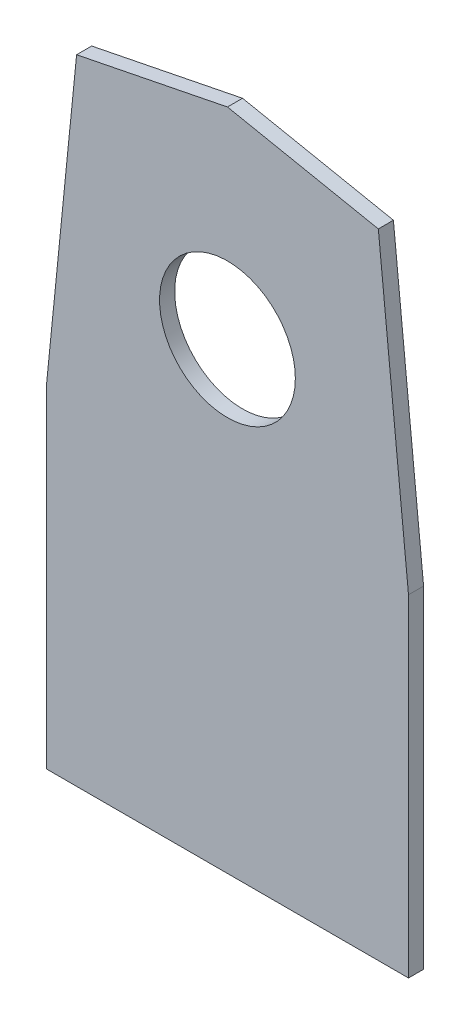
ISO-10303-21;
HEADER;
FILE_DESCRIPTION(('STEP AP214'),'2;1');
FILE_NAME('part.step','',(''),(''),'','','');
FILE_SCHEMA(('AUTOMOTIVE_DESIGN { 1 0 10303 214 1 1 1 1 }'));
ENDSEC;
DATA;
#1=APPLICATION_CONTEXT('core data for automotive mechanical design processes');
#2=APPLICATION_PROTOCOL_DEFINITION('international standard','automotive_design',2000,#1);
#3=PRODUCT_CONTEXT('',#1,'mechanical');
#4=PRODUCT('Part','Part','',(#3));
#5=PRODUCT_RELATED_PRODUCT_CATEGORY('part','',(#4));
#6=PRODUCT_DEFINITION_FORMATION('','',#4);
#7=PRODUCT_DEFINITION_CONTEXT('part definition',#1,'design');
#8=PRODUCT_DEFINITION('design','',#6,#7);
#9=PRODUCT_DEFINITION_SHAPE('','',#8);
#10=(LENGTH_UNIT() NAMED_UNIT(*) SI_UNIT(.MILLI.,.METRE.));
#11=(NAMED_UNIT(*) PLANE_ANGLE_UNIT() SI_UNIT($,.RADIAN.));
#12=(NAMED_UNIT(*) SI_UNIT($,.STERADIAN.) SOLID_ANGLE_UNIT());
#13=UNCERTAINTY_MEASURE_WITH_UNIT(LENGTH_MEASURE(1.E-05),#10,'distance_accuracy_value','');
#14=(GEOMETRIC_REPRESENTATION_CONTEXT(3) GLOBAL_UNCERTAINTY_ASSIGNED_CONTEXT((#13)) GLOBAL_UNIT_ASSIGNED_CONTEXT((#10,
#11,#12)) REPRESENTATION_CONTEXT('',''));
#15=CARTESIAN_POINT('',(0.,0.,0.));
#16=DIRECTION('',(0.,0.,1.));
#17=DIRECTION('',(1.,0.,0.));
#18=AXIS2_PLACEMENT_3D('',#15,#16,#17);
#19=CARTESIAN_POINT('',(-17.2944185212213,86.4720926061065,3.175));
#20=DIRECTION('',(0.196116135138184,-0.98058067569092,0.));
#21=DIRECTION('',(0.98058067569092,0.196116135138184,0.));
#22=AXIS2_PLACEMENT_3D('',#19,#20,#21);
#23=PLANE('',#22);
#24=DIRECTION('',(-0.98058067569092,-0.196116135138184,0.));
#25=VECTOR('',#24,1.);
#26=CARTESIAN_POINT('',(-17.2944185212213,86.4720926061065,0.));
#27=LINE('',#26,#25);
#28=CARTESIAN_POINT('',(-1.91986644476598,89.5470030213976,0.));
#29=VERTEX_POINT('',#28);
#30=CARTESIAN_POINT('',(-33.669866444766,83.1970030213976,0.));
#31=VERTEX_POINT('',#30);
#32=EDGE_CURVE('E126',#29,#31,#27,.T.);
#33=ORIENTED_EDGE('',*,*,#32,.T.);
#34=DIRECTION('',(0.,0.,-1.));
#35=VECTOR('',#34,1.);
#36=CARTESIAN_POINT('',(-33.669866444766,83.1970030213976,3.175));
#37=LINE('',#36,#35);
#38=CARTESIAN_POINT('',(-33.669866444766,83.1970030213976,3.175));
#39=VERTEX_POINT('',#38);
#40=EDGE_CURVE('E11',#39,#31,#37,.T.);
#41=ORIENTED_EDGE('',*,*,#40,.F.);
#42=DIRECTION('',(-0.98058067569092,-0.196116135138184,0.));
#43=VECTOR('',#42,1.);
#44=CARTESIAN_POINT('',(-17.2944185212213,86.4720926061065,3.175));
#45=LINE('',#44,#43);
#46=CARTESIAN_POINT('',(-1.91986644476598,89.5470030213976,3.175));
#47=VERTEX_POINT('',#46);
#48=EDGE_CURVE('E140',#47,#39,#45,.T.);
#49=ORIENTED_EDGE('',*,*,#48,.F.);
#50=DIRECTION('',(0.,0.,-1.));
#51=VECTOR('',#50,1.);
#52=CARTESIAN_POINT('',(-1.91986644476598,89.5470030213976,3.175));
#53=LINE('',#52,#51);
#54=EDGE_CURVE('E125',#47,#29,#53,.T.);
#55=ORIENTED_EDGE('',*,*,#54,.T.);
#56=EDGE_LOOP('',(#33,#41,#49,#55));
#57=FACE_BOUND('',#56,.T.);
#58=ADVANCED_FACE('F35',(#57),#23,.F.);
#59=CARTESIAN_POINT('',(-41.5738284622829,4.15738284622828,3.175));
#60=DIRECTION('',(0.995037190209989,-0.0995037190209987,0.));
#61=DIRECTION('',(0.0995037190209987,0.995037190209989,0.));
#62=AXIS2_PLACEMENT_3D('',#59,#60,#61);
#63=PLANE('',#62);
#64=DIRECTION('',(-0.0995037190209987,-0.995037190209989,0.));
#65=VECTOR('',#64,1.);
#66=CARTESIAN_POINT('',(-41.5738284622829,4.15738284622828,0.));
#67=LINE('',#66,#65);
#68=CARTESIAN_POINT('',(-40.019866444766,19.6970030213976,0.));
#69=VERTEX_POINT('',#68);
#70=EDGE_CURVE('E129',#31,#69,#67,.T.);
#71=ORIENTED_EDGE('',*,*,#70,.T.);
#72=DIRECTION('',(0.,0.,-1.));
#73=VECTOR('',#72,1.);
#74=CARTESIAN_POINT('',(-40.019866444766,19.6970030213976,3.175));
#75=LINE('',#74,#73);
#76=CARTESIAN_POINT('',(-40.019866444766,19.6970030213976,3.175));
#77=VERTEX_POINT('',#76);
#78=EDGE_CURVE('E43',#77,#69,#75,.T.);
#79=ORIENTED_EDGE('',*,*,#78,.F.);
#80=DIRECTION('',(-0.0995037190209987,-0.995037190209989,0.));
#81=VECTOR('',#80,1.);
#82=CARTESIAN_POINT('',(-41.5738284622829,4.15738284622828,3.175));
#83=LINE('',#82,#81);
#84=EDGE_CURVE('E90',#39,#77,#83,.T.);
#85=ORIENTED_EDGE('',*,*,#84,.F.);
#86=ORIENTED_EDGE('',*,*,#40,.T.);
#87=EDGE_LOOP('',(#71,#79,#85,#86));
#88=FACE_BOUND('',#87,.T.);
#89=ADVANCED_FACE('F165',(#88),#63,.F.);
#90=CARTESIAN_POINT('',(-40.019866444766,0.,3.175));
#91=DIRECTION('',(1.,0.,0.));
#92=DIRECTION('',(0.,1.,0.));
#93=AXIS2_PLACEMENT_3D('',#90,#91,#92);
#94=PLANE('',#93);
#95=DIRECTION('',(0.,-1.,0.));
#96=VECTOR('',#95,1.);
#97=CARTESIAN_POINT('',(-40.019866444766,0.,0.));
#98=LINE('',#97,#96);
#99=CARTESIAN_POINT('',(-40.019866444766,-50.1529969786024,0.));
#100=VERTEX_POINT('',#99);
#101=EDGE_CURVE('E132',#69,#100,#98,.T.);
#102=ORIENTED_EDGE('',*,*,#101,.T.);
#103=DIRECTION('',(0.,0.,-1.));
#104=VECTOR('',#103,1.);
#105=CARTESIAN_POINT('',(-40.019866444766,-50.1529969786024,3.175));
#106=LINE('',#105,#104);
#107=CARTESIAN_POINT('',(-40.019866444766,-50.1529969786024,3.175));
#108=VERTEX_POINT('',#107);
#109=EDGE_CURVE('E144',#108,#100,#106,.T.);
#110=ORIENTED_EDGE('',*,*,#109,.F.);
#111=DIRECTION('',(0.,-1.,0.));
#112=VECTOR('',#111,1.);
#113=CARTESIAN_POINT('',(-40.019866444766,0.,3.175));
#114=LINE('',#113,#112);
#115=EDGE_CURVE('E120',#77,#108,#114,.T.);
#116=ORIENTED_EDGE('',*,*,#115,.F.);
#117=ORIENTED_EDGE('',*,*,#78,.T.);
#118=EDGE_LOOP('',(#102,#110,#116,#117));
#119=FACE_BOUND('',#118,.T.);
#120=ADVANCED_FACE('F150',(#119),#94,.F.);
#121=CARTESIAN_POINT('',(0.,-50.1529969786024,3.175));
#122=DIRECTION('',(0.,1.,0.));
#123=DIRECTION('',(0.,0.,1.));
#124=AXIS2_PLACEMENT_3D('',#121,#122,#123);
#125=PLANE('',#124);
#126=DIRECTION('',(1.,0.,0.));
#127=VECTOR('',#126,1.);
#128=CARTESIAN_POINT('',(0.,-50.1529969786024,0.));
#129=LINE('',#128,#127);
#130=CARTESIAN_POINT('',(36.180133555234,-50.1529969786024,0.));
#131=VERTEX_POINT('',#130);
#132=EDGE_CURVE('E134',#100,#131,#129,.T.);
#133=ORIENTED_EDGE('',*,*,#132,.T.);
#134=DIRECTION('',(0.,0.,-1.));
#135=VECTOR('',#134,1.);
#136=CARTESIAN_POINT('',(36.180133555234,-50.1529969786024,3.175));
#137=LINE('',#136,#135);
#138=CARTESIAN_POINT('',(36.180133555234,-50.1529969786024,3.175));
#139=VERTEX_POINT('',#138);
#140=EDGE_CURVE('E109',#139,#131,#137,.T.);
#141=ORIENTED_EDGE('',*,*,#140,.F.);
#142=DIRECTION('',(1.,0.,0.));
#143=VECTOR('',#142,1.);
#144=CARTESIAN_POINT('',(0.,-50.1529969786024,3.175));
#145=LINE('',#144,#143);
#146=EDGE_CURVE('E117',#108,#139,#145,.T.);
#147=ORIENTED_EDGE('',*,*,#146,.F.);
#148=ORIENTED_EDGE('',*,*,#109,.T.);
#149=EDGE_LOOP('',(#133,#141,#147,#148));
#150=FACE_BOUND('',#149,.T.);
#151=ADVANCED_FACE('F157',(#150),#125,.F.);
#152=CARTESIAN_POINT('',(36.180133555234,0.,3.175));
#153=DIRECTION('',(1.,0.,0.));
#154=DIRECTION('',(0.,1.,0.));
#155=AXIS2_PLACEMENT_3D('',#152,#153,#154);
#156=PLANE('',#155);
#157=DIRECTION('',(0.,-1.,0.));
#158=VECTOR('',#157,1.);
#159=CARTESIAN_POINT('',(36.180133555234,0.,0.));
#160=LINE('',#159,#158);
#161=CARTESIAN_POINT('',(36.180133555234,19.6970030213976,0.));
#162=VERTEX_POINT('',#161);
#163=EDGE_CURVE('E108',#162,#131,#160,.T.);
#164=ORIENTED_EDGE('',*,*,#163,.F.);
#165=DIRECTION('',(0.,0.,-1.));
#166=VECTOR('',#165,1.);
#167=CARTESIAN_POINT('',(36.180133555234,19.6970030213976,3.175));
#168=LINE('',#167,#166);
#169=CARTESIAN_POINT('',(36.180133555234,19.6970030213976,3.175));
#170=VERTEX_POINT('',#169);
#171=EDGE_CURVE('E102',#170,#162,#168,.T.);
#172=ORIENTED_EDGE('',*,*,#171,.F.);
#173=DIRECTION('',(0.,-1.,0.));
#174=VECTOR('',#173,1.);
#175=CARTESIAN_POINT('',(36.180133555234,0.,3.175));
#176=LINE('',#175,#174);
#177=EDGE_CURVE('E106',#170,#139,#176,.T.);
#178=ORIENTED_EDGE('',*,*,#177,.T.);
#179=ORIENTED_EDGE('',*,*,#140,.T.);
#180=EDGE_LOOP('',(#164,#172,#178,#179));
#181=FACE_BOUND('',#180,.T.);
#182=ADVANCED_FACE('F104',(#181),#156,.T.);
#183=CARTESIAN_POINT('',(37.772112730073,3.77721127300731,3.175));
#184=DIRECTION('',(-0.995037190209989,-0.099503719020999,0.));
#185=DIRECTION('',(0.099503719020999,-0.995037190209989,0.));
#186=AXIS2_PLACEMENT_3D('',#183,#184,#185);
#187=PLANE('',#186);
#188=DIRECTION('',(-0.099503719020999,0.995037190209989,0.));
#189=VECTOR('',#188,1.);
#190=CARTESIAN_POINT('',(37.772112730073,3.77721127300731,0.));
#191=LINE('',#190,#189);
#192=CARTESIAN_POINT('',(29.830133555234,83.1970030213976,0.));
#193=VERTEX_POINT('',#192);
#194=EDGE_CURVE('E76',#162,#193,#191,.T.);
#195=ORIENTED_EDGE('',*,*,#194,.T.);
#196=DIRECTION('',(0.,0.,-1.));
#197=VECTOR('',#196,1.);
#198=CARTESIAN_POINT('',(29.830133555234,83.1970030213976,3.175));
#199=LINE('',#198,#197);
#200=CARTESIAN_POINT('',(29.830133555234,83.1970030213976,3.175));
#201=VERTEX_POINT('',#200);
#202=EDGE_CURVE('E110',#201,#193,#199,.T.);
#203=ORIENTED_EDGE('',*,*,#202,.F.);
#204=DIRECTION('',(-0.099503719020999,0.995037190209989,0.));
#205=VECTOR('',#204,1.);
#206=CARTESIAN_POINT('',(37.772112730073,3.77721127300731,3.175));
#207=LINE('',#206,#205);
#208=EDGE_CURVE('E112',#170,#201,#207,.T.);
#209=ORIENTED_EDGE('',*,*,#208,.F.);
#210=ORIENTED_EDGE('',*,*,#171,.T.);
#211=EDGE_LOOP('',(#195,#203,#209,#210));
#212=FACE_BOUND('',#211,.T.);
#213=ADVANCED_FACE('F113',(#212),#187,.F.);
#214=CARTESIAN_POINT('',(17.1467364870085,85.7336824350427,3.175));
#215=DIRECTION('',(-0.196116135138184,-0.98058067569092,0.));
#216=DIRECTION('',(0.98058067569092,-0.196116135138184,0.));
#217=AXIS2_PLACEMENT_3D('',#214,#215,#216);
#218=PLANE('',#217);
#219=DIRECTION('',(-0.98058067569092,0.196116135138184,0.));
#220=VECTOR('',#219,1.);
#221=CARTESIAN_POINT('',(17.1467364870085,85.7336824350427,0.));
#222=LINE('',#221,#220);
#223=EDGE_CURVE('E82',#193,#29,#222,.T.);
#224=ORIENTED_EDGE('',*,*,#223,.T.);
#225=ORIENTED_EDGE('',*,*,#54,.F.);
#226=DIRECTION('',(-0.98058067569092,0.196116135138184,0.));
#227=VECTOR('',#226,1.);
#228=CARTESIAN_POINT('',(17.1467364870085,85.7336824350427,3.175));
#229=LINE('',#228,#227);
#230=EDGE_CURVE('E51',#201,#47,#229,.T.);
#231=ORIENTED_EDGE('',*,*,#230,.F.);
#232=ORIENTED_EDGE('',*,*,#202,.T.);
#233=EDGE_LOOP('',(#224,#225,#231,#232));
#234=FACE_BOUND('',#233,.T.);
#235=ADVANCED_FACE('F174',(#234),#218,.F.);
#236=CARTESIAN_POINT('',(0.,0.,3.175));
#237=DIRECTION('',(0.,0.,1.));
#238=DIRECTION('',(1.,0.,0.));
#239=AXIS2_PLACEMENT_3D('',#236,#237,#238);
#240=PLANE('',#239);
#241=CARTESIAN_POINT('',(-1.91986644476598,47.2052030213976,3.175));
#242=DIRECTION('',(0.,0.,1.));
#243=DIRECTION('',(1.,0.,0.));
#244=AXIS2_PLACEMENT_3D('',#241,#242,#243);
#245=CIRCLE('',#244,14.2875);
#246=CARTESIAN_POINT('',(12.367633555234,47.2052030213976,3.175));
#247=VERTEX_POINT('',#246);
#248=EDGE_CURVE('E198',#247,#247,#245,.T.);
#249=ORIENTED_EDGE('',*,*,#248,.F.);
#250=EDGE_LOOP('',(#249));
#251=FACE_BOUND('',#250,.T.);
#252=ORIENTED_EDGE('',*,*,#48,.T.);
#253=ORIENTED_EDGE('',*,*,#84,.T.);
#254=ORIENTED_EDGE('',*,*,#115,.T.);
#255=ORIENTED_EDGE('',*,*,#146,.T.);
#256=ORIENTED_EDGE('',*,*,#177,.F.);
#257=ORIENTED_EDGE('',*,*,#208,.T.);
#258=ORIENTED_EDGE('',*,*,#230,.T.);
#259=EDGE_LOOP('',(#252,#253,#254,#255,#256,#257,#258));
#260=FACE_BOUND('',#259,.T.);
#261=ADVANCED_FACE('F115',(#251,#260),#240,.T.);
#262=CARTESIAN_POINT('',(0.,0.,0.));
#263=DIRECTION('',(0.,0.,1.));
#264=DIRECTION('',(1.,0.,0.));
#265=AXIS2_PLACEMENT_3D('',#262,#263,#264);
#266=PLANE('',#265);
#267=CARTESIAN_POINT('',(-1.91986644476598,47.2052030213976,0.));
#268=DIRECTION('',(0.,0.,1.));
#269=DIRECTION('',(1.,0.,0.));
#270=AXIS2_PLACEMENT_3D('',#267,#268,#269);
#271=CIRCLE('',#270,14.2875);
#272=CARTESIAN_POINT('',(12.367633555234,47.2052030213976,0.));
#273=VERTEX_POINT('',#272);
#274=EDGE_CURVE('E130',#273,#273,#271,.T.);
#275=ORIENTED_EDGE('',*,*,#274,.T.);
#276=EDGE_LOOP('',(#275));
#277=FACE_BOUND('',#276,.T.);
#278=ORIENTED_EDGE('',*,*,#32,.F.);
#279=ORIENTED_EDGE('',*,*,#223,.F.);
#280=ORIENTED_EDGE('',*,*,#194,.F.);
#281=ORIENTED_EDGE('',*,*,#163,.T.);
#282=ORIENTED_EDGE('',*,*,#132,.F.);
#283=ORIENTED_EDGE('',*,*,#101,.F.);
#284=ORIENTED_EDGE('',*,*,#70,.F.);
#285=EDGE_LOOP('',(#278,#279,#280,#281,#282,#283,#284));
#286=FACE_BOUND('',#285,.T.);
#287=ADVANCED_FACE('F155',(#277,#286),#266,.F.);
#288=CARTESIAN_POINT('',(-1.91986644476598,47.2052030213976,0.));
#289=DIRECTION('',(0.,0.,1.));
#290=DIRECTION('',(1.,0.,0.));
#291=AXIS2_PLACEMENT_3D('',#288,#289,#290);
#292=CYLINDRICAL_SURFACE('',#291,14.2875);
#293=ORIENTED_EDGE('',*,*,#274,.F.);
#294=EDGE_LOOP('',(#293));
#295=FACE_BOUND('',#294,.T.);
#296=ORIENTED_EDGE('',*,*,#248,.T.);
#297=EDGE_LOOP('',(#296));
#298=FACE_BOUND('',#297,.T.);
#299=ADVANCED_FACE('F186',(#295,#298),#292,.F.);
#300=CLOSED_SHELL('',(#58,#89,#120,#151,#182,#213,#235,#261,#287,#299));
#301=MANIFOLD_SOLID_BREP('B2',#300);
#302=ADVANCED_BREP_SHAPE_REPRESENTATION('',(#18,#301),#14);
#303=SHAPE_DEFINITION_REPRESENTATION(#9,#302);
ENDSEC;
END-ISO-10303-21;
